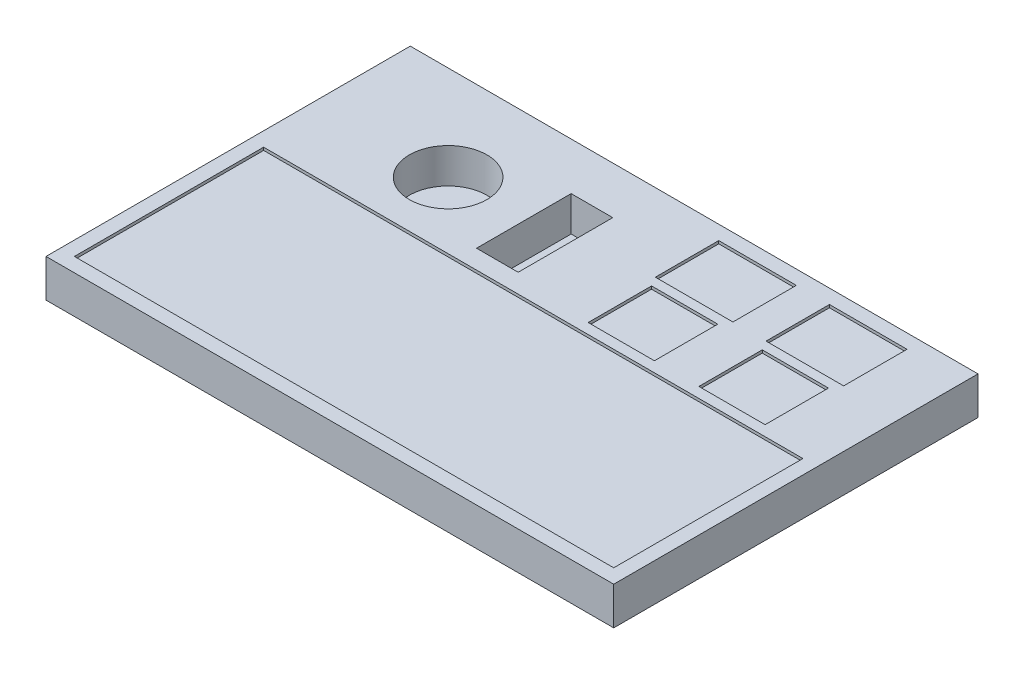
ISO-10303-21;
HEADER;
FILE_DESCRIPTION(('STEP AP214'),'2;1');
FILE_NAME('part.step','',(''),(''),'','','');
FILE_SCHEMA(('AUTOMOTIVE_DESIGN { 1 0 10303 214 1 1 1 1 }'));
ENDSEC;
DATA;
#1=APPLICATION_CONTEXT('core data for automotive mechanical design processes');
#2=APPLICATION_PROTOCOL_DEFINITION('international standard','automotive_design',2000,#1);
#3=PRODUCT_CONTEXT('',#1,'mechanical');
#4=PRODUCT('Part','Part','',(#3));
#5=PRODUCT_RELATED_PRODUCT_CATEGORY('part','',(#4));
#6=PRODUCT_DEFINITION_FORMATION('','',#4);
#7=PRODUCT_DEFINITION_CONTEXT('part definition',#1,'design');
#8=PRODUCT_DEFINITION('design','',#6,#7);
#9=PRODUCT_DEFINITION_SHAPE('','',#8);
#10=(LENGTH_UNIT() NAMED_UNIT(*) SI_UNIT(.MILLI.,.METRE.));
#11=(NAMED_UNIT(*) PLANE_ANGLE_UNIT() SI_UNIT($,.RADIAN.));
#12=(NAMED_UNIT(*) SI_UNIT($,.STERADIAN.) SOLID_ANGLE_UNIT());
#13=UNCERTAINTY_MEASURE_WITH_UNIT(LENGTH_MEASURE(1.E-05),#10,'distance_accuracy_value','');
#14=(GEOMETRIC_REPRESENTATION_CONTEXT(3) GLOBAL_UNCERTAINTY_ASSIGNED_CONTEXT((#13)) GLOBAL_UNIT_ASSIGNED_CONTEXT((#10,
#11,#12)) REPRESENTATION_CONTEXT('',''));
#15=CARTESIAN_POINT('',(0.,0.,0.));
#16=DIRECTION('',(0.,0.,1.));
#17=DIRECTION('',(1.,0.,0.));
#18=AXIS2_PLACEMENT_3D('',#15,#16,#17);
#19=CARTESIAN_POINT('',(0.,0.,0.));
#20=DIRECTION('',(0.,1.,0.));
#21=DIRECTION('',(0.,0.,1.));
#22=AXIS2_PLACEMENT_3D('',#19,#20,#21);
#23=PLANE('',#22);
#24=CARTESIAN_POINT('',(-160.,0.,-92.5000000000001));
#25=DIRECTION('',(0.,1.,0.));
#26=DIRECTION('',(0.,0.,1.));
#27=AXIS2_PLACEMENT_3D('',#24,#25,#26);
#28=CIRCLE('',#27,41.);
#29=CARTESIAN_POINT('',(-160.,0.,-51.5000000000001));
#30=VERTEX_POINT('',#29);
#31=EDGE_CURVE('E620',#30,#30,#28,.T.);
#32=ORIENTED_EDGE('',*,*,#31,.F.);
#33=EDGE_LOOP('',(#32));
#34=FACE_BOUND('',#33,.T.);
#35=DIRECTION('',(1.,0.,0.));
#36=VECTOR('',#35,1.);
#37=CARTESIAN_POINT('',(0.,0.,177.5));
#38=LINE('',#37,#36);
#39=CARTESIAN_POINT('',(-285.,0.,177.5));
#40=VERTEX_POINT('',#39);
#41=CARTESIAN_POINT('',(285.,0.,177.5));
#42=VERTEX_POINT('',#41);
#43=EDGE_CURVE('E290',#40,#42,#38,.T.);
#44=ORIENTED_EDGE('',*,*,#43,.F.);
#45=DIRECTION('',(0.,0.,1.));
#46=VECTOR('',#45,1.);
#47=CARTESIAN_POINT('',(-285.,0.,0.));
#48=LINE('',#47,#46);
#49=CARTESIAN_POINT('',(-285.,0.,-22.5000000000001));
#50=VERTEX_POINT('',#49);
#51=EDGE_CURVE('E292',#50,#40,#48,.T.);
#52=ORIENTED_EDGE('',*,*,#51,.F.);
#53=DIRECTION('',(1.,0.,0.));
#54=VECTOR('',#53,1.);
#55=CARTESIAN_POINT('',(0.,0.,-22.5000000000001));
#56=LINE('',#55,#54);
#57=CARTESIAN_POINT('',(285.,0.,-22.5000000000001));
#58=VERTEX_POINT('',#57);
#59=EDGE_CURVE('E296',#50,#58,#56,.T.);
#60=ORIENTED_EDGE('',*,*,#59,.T.);
#61=DIRECTION('',(0.,0.,1.));
#62=VECTOR('',#61,1.);
#63=CARTESIAN_POINT('',(285.,0.,0.));
#64=LINE('',#63,#62);
#65=EDGE_CURVE('E299',#58,#42,#64,.T.);
#66=ORIENTED_EDGE('',*,*,#65,.T.);
#67=EDGE_LOOP('',(#44,#52,#60,#66));
#68=FACE_BOUND('',#67,.T.);
#69=DIRECTION('',(0.,0.,-1.));
#70=VECTOR('',#69,1.);
#71=CARTESIAN_POINT('',(300.,0.,-192.5));
#72=LINE('',#71,#70);
#73=CARTESIAN_POINT('',(300.,0.,192.5));
#74=VERTEX_POINT('',#73);
#75=CARTESIAN_POINT('',(300.,0.,-192.5));
#76=VERTEX_POINT('',#75);
#77=EDGE_CURVE('E427',#74,#76,#72,.T.);
#78=ORIENTED_EDGE('',*,*,#77,.T.);
#79=DIRECTION('',(-1.,0.,0.));
#80=VECTOR('',#79,1.);
#81=CARTESIAN_POINT('',(-300.,0.,-192.5));
#82=LINE('',#81,#80);
#83=CARTESIAN_POINT('',(-300.,0.,-192.5));
#84=VERTEX_POINT('',#83);
#85=EDGE_CURVE('E449',#76,#84,#82,.T.);
#86=ORIENTED_EDGE('',*,*,#85,.T.);
#87=DIRECTION('',(0.,0.,1.));
#88=VECTOR('',#87,1.);
#89=CARTESIAN_POINT('',(-300.,0.,-192.5));
#90=LINE('',#89,#88);
#91=CARTESIAN_POINT('',(-300.,0.,192.5));
#92=VERTEX_POINT('',#91);
#93=EDGE_CURVE('E452',#84,#92,#90,.T.);
#94=ORIENTED_EDGE('',*,*,#93,.T.);
#95=DIRECTION('',(1.,0.,0.));
#96=VECTOR('',#95,1.);
#97=CARTESIAN_POINT('',(-300.,0.,192.5));
#98=LINE('',#97,#96);
#99=EDGE_CURVE('E438',#92,#74,#98,.T.);
#100=ORIENTED_EDGE('',*,*,#99,.T.);
#101=EDGE_LOOP('',(#78,#86,#94,#100));
#102=FACE_BOUND('',#101,.T.);
#103=DIRECTION('',(1.,0.,0.));
#104=VECTOR('',#103,1.);
#105=CARTESIAN_POINT('',(0.,0.,-177.5));
#106=LINE('',#105,#104);
#107=CARTESIAN_POINT('',(41.,0.,-177.5));
#108=VERTEX_POINT('',#107);
#109=CARTESIAN_POINT('',(123.,0.,-177.5));
#110=VERTEX_POINT('',#109);
#111=EDGE_CURVE('E417',#108,#110,#106,.T.);
#112=ORIENTED_EDGE('',*,*,#111,.T.);
#113=DIRECTION('',(0.,0.,1.));
#114=VECTOR('',#113,1.);
#115=CARTESIAN_POINT('',(123.,0.,0.));
#116=LINE('',#115,#114);
#117=CARTESIAN_POINT('',(123.,0.,-110.5));
#118=VERTEX_POINT('',#117);
#119=EDGE_CURVE('E365',#110,#118,#116,.T.);
#120=ORIENTED_EDGE('',*,*,#119,.T.);
#121=DIRECTION('',(1.,0.,0.));
#122=VECTOR('',#121,1.);
#123=CARTESIAN_POINT('',(0.,0.,-110.5));
#124=LINE('',#123,#122);
#125=CARTESIAN_POINT('',(41.,0.,-110.5));
#126=VERTEX_POINT('',#125);
#127=EDGE_CURVE('E406',#126,#118,#124,.T.);
#128=ORIENTED_EDGE('',*,*,#127,.F.);
#129=DIRECTION('',(0.,0.,1.));
#130=VECTOR('',#129,1.);
#131=CARTESIAN_POINT('',(40.9999999999999,0.,0.));
#132=LINE('',#131,#130);
#133=EDGE_CURVE('E420',#108,#126,#132,.T.);
#134=ORIENTED_EDGE('',*,*,#133,.F.);
#135=EDGE_LOOP('',(#112,#120,#128,#134));
#136=FACE_BOUND('',#135,.T.);
#137=DIRECTION('',(0.,0.,1.));
#138=VECTOR('',#137,1.);
#139=CARTESIAN_POINT('',(46.9999999999999,0.,-100.5));
#140=LINE('',#139,#138);
#141=CARTESIAN_POINT('',(46.9999999999999,0.,-100.5));
#142=VERTEX_POINT('',#141);
#143=CARTESIAN_POINT('',(46.9999999999999,0.,-33.5));
#144=VERTEX_POINT('',#143);
#145=EDGE_CURVE('E323',#142,#144,#140,.T.);
#146=ORIENTED_EDGE('',*,*,#145,.F.);
#147=DIRECTION('',(1.,0.,0.));
#148=VECTOR('',#147,1.);
#149=CARTESIAN_POINT('',(46.9999999999999,0.,-100.5));
#150=LINE('',#149,#148);
#151=CARTESIAN_POINT('',(117.,0.,-100.5));
#152=VERTEX_POINT('',#151);
#153=EDGE_CURVE('E289',#142,#152,#150,.T.);
#154=ORIENTED_EDGE('',*,*,#153,.T.);
#155=DIRECTION('',(0.,0.,1.));
#156=VECTOR('',#155,1.);
#157=CARTESIAN_POINT('',(117.,0.,-100.5));
#158=LINE('',#157,#156);
#159=CARTESIAN_POINT('',(117.,0.,-33.5));
#160=VERTEX_POINT('',#159);
#161=EDGE_CURVE('E330',#152,#160,#158,.T.);
#162=ORIENTED_EDGE('',*,*,#161,.T.);
#163=DIRECTION('',(1.,0.,0.));
#164=VECTOR('',#163,1.);
#165=CARTESIAN_POINT('',(46.9999999999999,0.,-33.5));
#166=LINE('',#165,#164);
#167=EDGE_CURVE('E326',#144,#160,#166,.T.);
#168=ORIENTED_EDGE('',*,*,#167,.F.);
#169=EDGE_LOOP('',(#146,#154,#162,#168));
#170=FACE_BOUND('',#169,.T.);
#171=DIRECTION('',(1.,0.,0.));
#172=VECTOR('',#171,1.);
#173=CARTESIAN_POINT('',(0.,0.,-100.5));
#174=LINE('',#173,#172);
#175=CARTESIAN_POINT('',(164.,0.,-100.5));
#176=VERTEX_POINT('',#175);
#177=CARTESIAN_POINT('',(234.,0.,-100.5));
#178=VERTEX_POINT('',#177);
#179=EDGE_CURVE('E390',#176,#178,#174,.T.);
#180=ORIENTED_EDGE('',*,*,#179,.T.);
#181=DIRECTION('',(0.,0.,1.));
#182=VECTOR('',#181,1.);
#183=CARTESIAN_POINT('',(233.999999999999,0.,2.32649720384137E-12));
#184=LINE('',#183,#182);
#185=CARTESIAN_POINT('',(234.,0.,-33.5));
#186=VERTEX_POINT('',#185);
#187=EDGE_CURVE('E353',#178,#186,#184,.T.);
#188=ORIENTED_EDGE('',*,*,#187,.T.);
#189=DIRECTION('',(1.,0.,0.));
#190=VECTOR('',#189,1.);
#191=CARTESIAN_POINT('',(0.,0.,-33.5));
#192=LINE('',#191,#190);
#193=CARTESIAN_POINT('',(163.999999999999,0.,-33.5));
#194=VERTEX_POINT('',#193);
#195=EDGE_CURVE('E383',#194,#186,#192,.T.);
#196=ORIENTED_EDGE('',*,*,#195,.F.);
#197=DIRECTION('',(0.,0.,1.));
#198=VECTOR('',#197,1.);
#199=CARTESIAN_POINT('',(163.999999999999,0.,1.63053650183753E-12));
#200=LINE('',#199,#198);
#201=EDGE_CURVE('E386',#176,#194,#200,.T.);
#202=ORIENTED_EDGE('',*,*,#201,.F.);
#203=EDGE_LOOP('',(#180,#188,#196,#202));
#204=FACE_BOUND('',#203,.T.);
#205=DIRECTION('',(1.,0.,0.));
#206=VECTOR('',#205,1.);
#207=CARTESIAN_POINT('',(0.,0.,-177.5));
#208=LINE('',#207,#206);
#209=CARTESIAN_POINT('',(158.,0.,-177.5));
#210=VERTEX_POINT('',#209);
#211=CARTESIAN_POINT('',(240.,0.,-177.5));
#212=VERTEX_POINT('',#211);
#213=EDGE_CURVE('E361',#210,#212,#208,.T.);
#214=ORIENTED_EDGE('',*,*,#213,.T.);
#215=DIRECTION('',(0.,0.,1.));
#216=VECTOR('',#215,1.);
#217=CARTESIAN_POINT('',(240.,0.,0.));
#218=LINE('',#217,#216);
#219=CARTESIAN_POINT('',(240.,0.,-110.5));
#220=VERTEX_POINT('',#219);
#221=EDGE_CURVE('E84',#212,#220,#218,.T.);
#222=ORIENTED_EDGE('',*,*,#221,.T.);
#223=DIRECTION('',(1.,0.,0.));
#224=VECTOR('',#223,1.);
#225=CARTESIAN_POINT('',(0.,0.,-110.5));
#226=LINE('',#225,#224);
#227=CARTESIAN_POINT('',(158.,0.,-110.5));
#228=VERTEX_POINT('',#227);
#229=EDGE_CURVE('E354',#228,#220,#226,.T.);
#230=ORIENTED_EDGE('',*,*,#229,.F.);
#231=DIRECTION('',(0.,0.,1.));
#232=VECTOR('',#231,1.);
#233=CARTESIAN_POINT('',(158.,0.,0.));
#234=LINE('',#233,#232);
#235=EDGE_CURVE('E357',#210,#228,#234,.T.);
#236=ORIENTED_EDGE('',*,*,#235,.F.);
#237=EDGE_LOOP('',(#214,#222,#230,#236));
#238=FACE_BOUND('',#237,.T.);
#239=DIRECTION('',(0.,0.,1.));
#240=VECTOR('',#239,1.);
#241=CARTESIAN_POINT('',(-79.9999999999998,0.,0.));
#242=LINE('',#241,#240);
#243=CARTESIAN_POINT('',(-79.9999999999999,0.,-142.5));
#244=VERTEX_POINT('',#243);
#245=CARTESIAN_POINT('',(-79.9999999999998,0.,-42.5));
#246=VERTEX_POINT('',#245);
#247=EDGE_CURVE('E267',#244,#246,#242,.T.);
#248=ORIENTED_EDGE('',*,*,#247,.F.);
#249=DIRECTION('',(1.,0.,0.));
#250=VECTOR('',#249,1.);
#251=CARTESIAN_POINT('',(0.,0.,-142.5));
#252=LINE('',#251,#250);
#253=CARTESIAN_POINT('',(-35.9999999999999,0.,-142.5));
#254=VERTEX_POINT('',#253);
#255=EDGE_CURVE('E252',#244,#254,#252,.T.);
#256=ORIENTED_EDGE('',*,*,#255,.T.);
#257=DIRECTION('',(0.,0.,1.));
#258=VECTOR('',#257,1.);
#259=CARTESIAN_POINT('',(-35.9999999999999,0.,0.));
#260=LINE('',#259,#258);
#261=CARTESIAN_POINT('',(-35.9999999999999,0.,-42.5));
#262=VERTEX_POINT('',#261);
#263=EDGE_CURVE('E261',#254,#262,#260,.T.);
#264=ORIENTED_EDGE('',*,*,#263,.T.);
#265=DIRECTION('',(1.,0.,0.));
#266=VECTOR('',#265,1.);
#267=CARTESIAN_POINT('',(0.,0.,-42.5));
#268=LINE('',#267,#266);
#269=EDGE_CURVE('E76',#246,#262,#268,.T.);
#270=ORIENTED_EDGE('',*,*,#269,.F.);
#271=EDGE_LOOP('',(#248,#256,#264,#270));
#272=FACE_BOUND('',#271,.T.);
#273=ADVANCED_FACE('F59',(#34,#68,#102,#136,#170,#204,#238,#272),#23,.T.);
#274=CARTESIAN_POINT('',(300.,-40.,-192.5));
#275=DIRECTION('',(1.,0.,0.));
#276=DIRECTION('',(0.,0.,-1.));
#277=AXIS2_PLACEMENT_3D('',#274,#275,#276);
#278=PLANE('',#277);
#279=ORIENTED_EDGE('',*,*,#77,.F.);
#280=DIRECTION('',(0.,1.,0.));
#281=VECTOR('',#280,1.);
#282=CARTESIAN_POINT('',(300.,-40.,192.5));
#283=LINE('',#282,#281);
#284=CARTESIAN_POINT('',(300.,-40.,192.5));
#285=VERTEX_POINT('',#284);
#286=EDGE_CURVE('E13',#285,#74,#283,.T.);
#287=ORIENTED_EDGE('',*,*,#286,.F.);
#288=DIRECTION('',(0.,0.,-1.));
#289=VECTOR('',#288,1.);
#290=CARTESIAN_POINT('',(300.,-40.,-192.5));
#291=LINE('',#290,#289);
#292=CARTESIAN_POINT('',(300.,-40.,-192.5));
#293=VERTEX_POINT('',#292);
#294=EDGE_CURVE('E434',#285,#293,#291,.T.);
#295=ORIENTED_EDGE('',*,*,#294,.T.);
#296=DIRECTION('',(0.,1.,0.));
#297=VECTOR('',#296,1.);
#298=CARTESIAN_POINT('',(300.,-40.,-192.5));
#299=LINE('',#298,#297);
#300=EDGE_CURVE('E63',#293,#76,#299,.T.);
#301=ORIENTED_EDGE('',*,*,#300,.T.);
#302=EDGE_LOOP('',(#279,#287,#295,#301));
#303=FACE_BOUND('',#302,.T.);
#304=ADVANCED_FACE('F61',(#303),#278,.T.);
#305=CARTESIAN_POINT('',(-300.,-40.,192.5));
#306=DIRECTION('',(0.,0.,1.));
#307=DIRECTION('',(1.,0.,0.));
#308=AXIS2_PLACEMENT_3D('',#305,#306,#307);
#309=PLANE('',#308);
#310=ORIENTED_EDGE('',*,*,#99,.F.);
#311=DIRECTION('',(0.,1.,0.));
#312=VECTOR('',#311,1.);
#313=CARTESIAN_POINT('',(-300.,-40.,192.5));
#314=LINE('',#313,#312);
#315=CARTESIAN_POINT('',(-300.,-40.,192.5));
#316=VERTEX_POINT('',#315);
#317=EDGE_CURVE('E68',#316,#92,#314,.T.);
#318=ORIENTED_EDGE('',*,*,#317,.F.);
#319=DIRECTION('',(1.,0.,0.));
#320=VECTOR('',#319,1.);
#321=CARTESIAN_POINT('',(-300.,-40.,192.5));
#322=LINE('',#321,#320);
#323=EDGE_CURVE('E444',#316,#285,#322,.T.);
#324=ORIENTED_EDGE('',*,*,#323,.T.);
#325=ORIENTED_EDGE('',*,*,#286,.T.);
#326=EDGE_LOOP('',(#310,#318,#324,#325));
#327=FACE_BOUND('',#326,.T.);
#328=ADVANCED_FACE('F470',(#327),#309,.T.);
#329=CARTESIAN_POINT('',(-300.,-40.,-192.5));
#330=DIRECTION('',(-1.,0.,0.));
#331=DIRECTION('',(0.,0.,1.));
#332=AXIS2_PLACEMENT_3D('',#329,#330,#331);
#333=PLANE('',#332);
#334=ORIENTED_EDGE('',*,*,#93,.F.);
#335=DIRECTION('',(0.,1.,0.));
#336=VECTOR('',#335,1.);
#337=CARTESIAN_POINT('',(-300.,-40.,-192.5));
#338=LINE('',#337,#336);
#339=CARTESIAN_POINT('',(-300.,-40.,-192.5));
#340=VERTEX_POINT('',#339);
#341=EDGE_CURVE('E457',#340,#84,#338,.T.);
#342=ORIENTED_EDGE('',*,*,#341,.F.);
#343=DIRECTION('',(0.,0.,1.));
#344=VECTOR('',#343,1.);
#345=CARTESIAN_POINT('',(-300.,-40.,-192.5));
#346=LINE('',#345,#344);
#347=EDGE_CURVE('E441',#340,#316,#346,.T.);
#348=ORIENTED_EDGE('',*,*,#347,.T.);
#349=ORIENTED_EDGE('',*,*,#317,.T.);
#350=EDGE_LOOP('',(#334,#342,#348,#349));
#351=FACE_BOUND('',#350,.T.);
#352=ADVANCED_FACE('F476',(#351),#333,.T.);
#353=CARTESIAN_POINT('',(-300.,-40.,-192.5));
#354=DIRECTION('',(0.,0.,-1.));
#355=DIRECTION('',(-1.,0.,0.));
#356=AXIS2_PLACEMENT_3D('',#353,#354,#355);
#357=PLANE('',#356);
#358=ORIENTED_EDGE('',*,*,#85,.F.);
#359=ORIENTED_EDGE('',*,*,#300,.F.);
#360=DIRECTION('',(-1.,0.,0.));
#361=VECTOR('',#360,1.);
#362=CARTESIAN_POINT('',(-300.,-40.,-192.5));
#363=LINE('',#362,#361);
#364=EDGE_CURVE('E437',#293,#340,#363,.T.);
#365=ORIENTED_EDGE('',*,*,#364,.T.);
#366=ORIENTED_EDGE('',*,*,#341,.T.);
#367=EDGE_LOOP('',(#358,#359,#365,#366));
#368=FACE_BOUND('',#367,.T.);
#369=ADVANCED_FACE('F465',(#368),#357,.T.);
#370=CARTESIAN_POINT('',(0.,-40.,0.));
#371=DIRECTION('',(0.,1.,0.));
#372=DIRECTION('',(0.,0.,1.));
#373=AXIS2_PLACEMENT_3D('',#370,#371,#372);
#374=PLANE('',#373);
#375=ORIENTED_EDGE('',*,*,#294,.F.);
#376=ORIENTED_EDGE('',*,*,#323,.F.);
#377=ORIENTED_EDGE('',*,*,#347,.F.);
#378=ORIENTED_EDGE('',*,*,#364,.F.);
#379=EDGE_LOOP('',(#375,#376,#377,#378));
#380=FACE_BOUND('',#379,.T.);
#381=ADVANCED_FACE('F473',(#380),#374,.F.);
#382=CARTESIAN_POINT('',(123.,-3.,0.));
#383=DIRECTION('',(-1.,0.,0.));
#384=DIRECTION('',(0.,0.,1.));
#385=AXIS2_PLACEMENT_3D('',#382,#383,#384);
#386=PLANE('',#385);
#387=ORIENTED_EDGE('',*,*,#119,.F.);
#388=DIRECTION('',(0.,1.,0.));
#389=VECTOR('',#388,1.);
#390=CARTESIAN_POINT('',(123.,-3.,-177.5));
#391=LINE('',#390,#389);
#392=CARTESIAN_POINT('',(123.,-3.,-177.5));
#393=VERTEX_POINT('',#392);
#394=EDGE_CURVE('E414',#393,#110,#391,.T.);
#395=ORIENTED_EDGE('',*,*,#394,.F.);
#396=DIRECTION('',(0.,0.,1.));
#397=VECTOR('',#396,1.);
#398=CARTESIAN_POINT('',(123.,-3.,0.));
#399=LINE('',#398,#397);
#400=CARTESIAN_POINT('',(123.,-3.,-110.5));
#401=VERTEX_POINT('',#400);
#402=EDGE_CURVE('E403',#393,#401,#399,.T.);
#403=ORIENTED_EDGE('',*,*,#402,.T.);
#404=DIRECTION('',(0.,1.,0.));
#405=VECTOR('',#404,1.);
#406=CARTESIAN_POINT('',(123.,-3.,-110.5));
#407=LINE('',#406,#405);
#408=EDGE_CURVE('E425',#401,#118,#407,.T.);
#409=ORIENTED_EDGE('',*,*,#408,.T.);
#410=EDGE_LOOP('',(#387,#395,#403,#409));
#411=FACE_BOUND('',#410,.T.);
#412=ADVANCED_FACE('F495',(#411),#386,.T.);
#413=CARTESIAN_POINT('',(0.,-3.,-110.5));
#414=DIRECTION('',(0.,0.,1.));
#415=DIRECTION('',(1.,0.,0.));
#416=AXIS2_PLACEMENT_3D('',#413,#414,#415);
#417=PLANE('',#416);
#418=ORIENTED_EDGE('',*,*,#127,.T.);
#419=ORIENTED_EDGE('',*,*,#408,.F.);
#420=DIRECTION('',(1.,0.,0.));
#421=VECTOR('',#420,1.);
#422=CARTESIAN_POINT('',(0.,-3.,-110.5));
#423=LINE('',#422,#421);
#424=CARTESIAN_POINT('',(41.,-3.,-110.5));
#425=VERTEX_POINT('',#424);
#426=EDGE_CURVE('E411',#425,#401,#423,.T.);
#427=ORIENTED_EDGE('',*,*,#426,.F.);
#428=DIRECTION('',(0.,1.,0.));
#429=VECTOR('',#428,1.);
#430=CARTESIAN_POINT('',(41.,-3.,-110.5));
#431=LINE('',#430,#429);
#432=EDGE_CURVE('E428',#425,#126,#431,.T.);
#433=ORIENTED_EDGE('',*,*,#432,.T.);
#434=EDGE_LOOP('',(#418,#419,#427,#433));
#435=FACE_BOUND('',#434,.T.);
#436=ADVANCED_FACE('F498',(#435),#417,.F.);
#437=CARTESIAN_POINT('',(40.9999999999999,-3.,0.));
#438=DIRECTION('',(-1.,0.,0.));
#439=DIRECTION('',(0.,0.,1.));
#440=AXIS2_PLACEMENT_3D('',#437,#438,#439);
#441=PLANE('',#440);
#442=ORIENTED_EDGE('',*,*,#133,.T.);
#443=ORIENTED_EDGE('',*,*,#432,.F.);
#444=DIRECTION('',(0.,0.,1.));
#445=VECTOR('',#444,1.);
#446=CARTESIAN_POINT('',(40.9999999999999,-3.,0.));
#447=LINE('',#446,#445);
#448=CARTESIAN_POINT('',(41.,-3.,-177.5));
#449=VERTEX_POINT('',#448);
#450=EDGE_CURVE('E408',#449,#425,#447,.T.);
#451=ORIENTED_EDGE('',*,*,#450,.F.);
#452=DIRECTION('',(0.,1.,0.));
#453=VECTOR('',#452,1.);
#454=CARTESIAN_POINT('',(41.,-3.,-177.5));
#455=LINE('',#454,#453);
#456=EDGE_CURVE('E430',#449,#108,#455,.T.);
#457=ORIENTED_EDGE('',*,*,#456,.T.);
#458=EDGE_LOOP('',(#442,#443,#451,#457));
#459=FACE_BOUND('',#458,.T.);
#460=ADVANCED_FACE('F504',(#459),#441,.F.);
#461=CARTESIAN_POINT('',(0.,-3.,-177.5));
#462=DIRECTION('',(0.,0.,1.));
#463=DIRECTION('',(1.,0.,0.));
#464=AXIS2_PLACEMENT_3D('',#461,#462,#463);
#465=PLANE('',#464);
#466=ORIENTED_EDGE('',*,*,#111,.F.);
#467=ORIENTED_EDGE('',*,*,#456,.F.);
#468=DIRECTION('',(1.,0.,0.));
#469=VECTOR('',#468,1.);
#470=CARTESIAN_POINT('',(0.,-3.,-177.5));
#471=LINE('',#470,#469);
#472=EDGE_CURVE('E405',#449,#393,#471,.T.);
#473=ORIENTED_EDGE('',*,*,#472,.T.);
#474=ORIENTED_EDGE('',*,*,#394,.T.);
#475=EDGE_LOOP('',(#466,#467,#473,#474));
#476=FACE_BOUND('',#475,.T.);
#477=ADVANCED_FACE('F500',(#476),#465,.T.);
#478=CARTESIAN_POINT('',(0.,-3.,0.));
#479=DIRECTION('',(0.,1.,0.));
#480=DIRECTION('',(0.,0.,1.));
#481=AXIS2_PLACEMENT_3D('',#478,#479,#480);
#482=PLANE('',#481);
#483=ORIENTED_EDGE('',*,*,#402,.F.);
#484=ORIENTED_EDGE('',*,*,#472,.F.);
#485=ORIENTED_EDGE('',*,*,#450,.T.);
#486=ORIENTED_EDGE('',*,*,#426,.T.);
#487=EDGE_LOOP('',(#483,#484,#485,#486));
#488=FACE_BOUND('',#487,.T.);
#489=ADVANCED_FACE('F503',(#488),#482,.T.);
#490=CARTESIAN_POINT('',(46.9999999999999,-3.,-100.5));
#491=DIRECTION('',(0.,0.,1.));
#492=DIRECTION('',(1.,0.,0.));
#493=AXIS2_PLACEMENT_3D('',#490,#491,#492);
#494=PLANE('',#493);
#495=ORIENTED_EDGE('',*,*,#153,.F.);
#496=DIRECTION('',(0.,1.,0.));
#497=VECTOR('',#496,1.);
#498=CARTESIAN_POINT('',(46.9999999999999,-3.,-100.5));
#499=LINE('',#498,#497);
#500=CARTESIAN_POINT('',(46.9999999999999,-3.,-100.5));
#501=VERTEX_POINT('',#500);
#502=EDGE_CURVE('E319',#501,#142,#499,.T.);
#503=ORIENTED_EDGE('',*,*,#502,.F.);
#504=DIRECTION('',(1.,0.,0.));
#505=VECTOR('',#504,1.);
#506=CARTESIAN_POINT('',(46.9999999999999,-3.,-100.5));
#507=LINE('',#506,#505);
#508=CARTESIAN_POINT('',(117.,-3.,-100.5));
#509=VERTEX_POINT('',#508);
#510=EDGE_CURVE('E327',#501,#509,#507,.T.);
#511=ORIENTED_EDGE('',*,*,#510,.T.);
#512=DIRECTION('',(0.,1.,0.));
#513=VECTOR('',#512,1.);
#514=CARTESIAN_POINT('',(117.,-3.,-100.5));
#515=LINE('',#514,#513);
#516=EDGE_CURVE('E311',#509,#152,#515,.T.);
#517=ORIENTED_EDGE('',*,*,#516,.T.);
#518=EDGE_LOOP('',(#495,#503,#511,#517));
#519=FACE_BOUND('',#518,.T.);
#520=ADVANCED_FACE('F514',(#519),#494,.T.);
#521=CARTESIAN_POINT('',(117.,-3.,-100.5));
#522=DIRECTION('',(-1.,0.,0.));
#523=DIRECTION('',(0.,0.,1.));
#524=AXIS2_PLACEMENT_3D('',#521,#522,#523);
#525=PLANE('',#524);
#526=ORIENTED_EDGE('',*,*,#161,.F.);
#527=ORIENTED_EDGE('',*,*,#516,.F.);
#528=DIRECTION('',(0.,0.,1.));
#529=VECTOR('',#528,1.);
#530=CARTESIAN_POINT('',(117.,-3.,-100.5));
#531=LINE('',#530,#529);
#532=CARTESIAN_POINT('',(117.,-3.,-33.5));
#533=VERTEX_POINT('',#532);
#534=EDGE_CURVE('E340',#509,#533,#531,.T.);
#535=ORIENTED_EDGE('',*,*,#534,.T.);
#536=DIRECTION('',(0.,1.,0.));
#537=VECTOR('',#536,1.);
#538=CARTESIAN_POINT('',(117.,-3.,-33.5));
#539=LINE('',#538,#537);
#540=EDGE_CURVE('E314',#533,#160,#539,.T.);
#541=ORIENTED_EDGE('',*,*,#540,.T.);
#542=EDGE_LOOP('',(#526,#527,#535,#541));
#543=FACE_BOUND('',#542,.T.);
#544=ADVANCED_FACE('F568',(#543),#525,.T.);
#545=CARTESIAN_POINT('',(46.9999999999999,-3.,-33.5));
#546=DIRECTION('',(0.,0.,1.));
#547=DIRECTION('',(1.,0.,0.));
#548=AXIS2_PLACEMENT_3D('',#545,#546,#547);
#549=PLANE('',#548);
#550=ORIENTED_EDGE('',*,*,#167,.T.);
#551=ORIENTED_EDGE('',*,*,#540,.F.);
#552=DIRECTION('',(1.,0.,0.));
#553=VECTOR('',#552,1.);
#554=CARTESIAN_POINT('',(46.9999999999999,-3.,-33.5));
#555=LINE('',#554,#553);
#556=CARTESIAN_POINT('',(46.9999999999999,-3.,-33.5));
#557=VERTEX_POINT('',#556);
#558=EDGE_CURVE('E337',#557,#533,#555,.T.);
#559=ORIENTED_EDGE('',*,*,#558,.F.);
#560=DIRECTION('',(0.,1.,0.));
#561=VECTOR('',#560,1.);
#562=CARTESIAN_POINT('',(46.9999999999999,-3.,-33.5));
#563=LINE('',#562,#561);
#564=EDGE_CURVE('E317',#557,#144,#563,.T.);
#565=ORIENTED_EDGE('',*,*,#564,.T.);
#566=EDGE_LOOP('',(#550,#551,#559,#565));
#567=FACE_BOUND('',#566,.T.);
#568=ADVANCED_FACE('F564',(#567),#549,.F.);
#569=CARTESIAN_POINT('',(46.9999999999999,-3.,-100.5));
#570=DIRECTION('',(-1.,0.,0.));
#571=DIRECTION('',(0.,0.,1.));
#572=AXIS2_PLACEMENT_3D('',#569,#570,#571);
#573=PLANE('',#572);
#574=ORIENTED_EDGE('',*,*,#145,.T.);
#575=ORIENTED_EDGE('',*,*,#564,.F.);
#576=DIRECTION('',(0.,0.,1.));
#577=VECTOR('',#576,1.);
#578=CARTESIAN_POINT('',(46.9999999999999,-3.,-100.5));
#579=LINE('',#578,#577);
#580=EDGE_CURVE('E322',#501,#557,#579,.T.);
#581=ORIENTED_EDGE('',*,*,#580,.F.);
#582=ORIENTED_EDGE('',*,*,#502,.T.);
#583=EDGE_LOOP('',(#574,#575,#581,#582));
#584=FACE_BOUND('',#583,.T.);
#585=ADVANCED_FACE('F560',(#584),#573,.F.);
#586=CARTESIAN_POINT('',(0.,-3.,0.));
#587=DIRECTION('',(0.,-1.,0.));
#588=DIRECTION('',(0.,0.,-1.));
#589=AXIS2_PLACEMENT_3D('',#586,#587,#588);
#590=PLANE('',#589);
#591=ORIENTED_EDGE('',*,*,#510,.F.);
#592=ORIENTED_EDGE('',*,*,#580,.T.);
#593=ORIENTED_EDGE('',*,*,#558,.T.);
#594=ORIENTED_EDGE('',*,*,#534,.F.);
#595=EDGE_LOOP('',(#591,#592,#593,#594));
#596=FACE_BOUND('',#595,.T.);
#597=ADVANCED_FACE('F556',(#596),#590,.F.);
#598=CARTESIAN_POINT('',(0.,-3.,177.5));
#599=DIRECTION('',(0.,0.,1.));
#600=DIRECTION('',(1.,0.,0.));
#601=AXIS2_PLACEMENT_3D('',#598,#599,#600);
#602=PLANE('',#601);
#603=ORIENTED_EDGE('',*,*,#43,.T.);
#604=DIRECTION('',(0.,1.,0.));
#605=VECTOR('',#604,1.);
#606=CARTESIAN_POINT('',(285.,-3.,177.5));
#607=LINE('',#606,#605);
#608=CARTESIAN_POINT('',(285.,-3.,177.5));
#609=VERTEX_POINT('',#608);
#610=EDGE_CURVE('E286',#609,#42,#607,.T.);
#611=ORIENTED_EDGE('',*,*,#610,.F.);
#612=DIRECTION('',(1.,0.,0.));
#613=VECTOR('',#612,1.);
#614=CARTESIAN_POINT('',(0.,-3.,177.5));
#615=LINE('',#614,#613);
#616=CARTESIAN_POINT('',(-285.,-3.,177.5));
#617=VERTEX_POINT('',#616);
#618=EDGE_CURVE('E281',#617,#609,#615,.T.);
#619=ORIENTED_EDGE('',*,*,#618,.F.);
#620=DIRECTION('',(0.,1.,0.));
#621=VECTOR('',#620,1.);
#622=CARTESIAN_POINT('',(-285.,-3.,177.5));
#623=LINE('',#622,#621);
#624=EDGE_CURVE('E284',#617,#40,#623,.T.);
#625=ORIENTED_EDGE('',*,*,#624,.T.);
#626=EDGE_LOOP('',(#603,#611,#619,#625));
#627=FACE_BOUND('',#626,.T.);
#628=ADVANCED_FACE('F559',(#627),#602,.F.);
#629=CARTESIAN_POINT('',(-285.,-3.,0.));
#630=DIRECTION('',(-1.,0.,0.));
#631=DIRECTION('',(0.,0.,1.));
#632=AXIS2_PLACEMENT_3D('',#629,#630,#631);
#633=PLANE('',#632);
#634=ORIENTED_EDGE('',*,*,#51,.T.);
#635=ORIENTED_EDGE('',*,*,#624,.F.);
#636=DIRECTION('',(0.,0.,1.));
#637=VECTOR('',#636,1.);
#638=CARTESIAN_POINT('',(-285.,-3.,0.));
#639=LINE('',#638,#637);
#640=CARTESIAN_POINT('',(-285.,-3.,-22.5000000000001));
#641=VERTEX_POINT('',#640);
#642=EDGE_CURVE('E305',#641,#617,#639,.T.);
#643=ORIENTED_EDGE('',*,*,#642,.F.);
#644=DIRECTION('',(0.,1.,0.));
#645=VECTOR('',#644,1.);
#646=CARTESIAN_POINT('',(-285.,-3.,-22.5000000000001));
#647=LINE('',#646,#645);
#648=EDGE_CURVE('E282',#641,#50,#647,.T.);
#649=ORIENTED_EDGE('',*,*,#648,.T.);
#650=EDGE_LOOP('',(#634,#635,#643,#649));
#651=FACE_BOUND('',#650,.T.);
#652=ADVANCED_FACE('F582',(#651),#633,.F.);
#653=CARTESIAN_POINT('',(0.,-3.,-22.5000000000001));
#654=DIRECTION('',(0.,0.,1.));
#655=DIRECTION('',(1.,0.,0.));
#656=AXIS2_PLACEMENT_3D('',#653,#654,#655);
#657=PLANE('',#656);
#658=ORIENTED_EDGE('',*,*,#59,.F.);
#659=ORIENTED_EDGE('',*,*,#648,.F.);
#660=DIRECTION('',(1.,0.,0.));
#661=VECTOR('',#660,1.);
#662=CARTESIAN_POINT('',(0.,-3.,-22.5000000000001));
#663=LINE('',#662,#661);
#664=CARTESIAN_POINT('',(285.,-3.,-22.5000000000001));
#665=VERTEX_POINT('',#664);
#666=EDGE_CURVE('E308',#641,#665,#663,.T.);
#667=ORIENTED_EDGE('',*,*,#666,.T.);
#668=DIRECTION('',(0.,1.,0.));
#669=VECTOR('',#668,1.);
#670=CARTESIAN_POINT('',(285.,-3.,-22.5000000000001));
#671=LINE('',#670,#669);
#672=EDGE_CURVE('E279',#665,#58,#671,.T.);
#673=ORIENTED_EDGE('',*,*,#672,.T.);
#674=EDGE_LOOP('',(#658,#659,#667,#673));
#675=FACE_BOUND('',#674,.T.);
#676=ADVANCED_FACE('F586',(#675),#657,.T.);
#677=CARTESIAN_POINT('',(285.,-3.,0.));
#678=DIRECTION('',(-1.,0.,0.));
#679=DIRECTION('',(0.,0.,1.));
#680=AXIS2_PLACEMENT_3D('',#677,#678,#679);
#681=PLANE('',#680);
#682=ORIENTED_EDGE('',*,*,#65,.F.);
#683=ORIENTED_EDGE('',*,*,#672,.F.);
#684=DIRECTION('',(0.,0.,1.));
#685=VECTOR('',#684,1.);
#686=CARTESIAN_POINT('',(285.,-3.,0.));
#687=LINE('',#686,#685);
#688=EDGE_CURVE('E293',#665,#609,#687,.T.);
#689=ORIENTED_EDGE('',*,*,#688,.T.);
#690=ORIENTED_EDGE('',*,*,#610,.T.);
#691=EDGE_LOOP('',(#682,#683,#689,#690));
#692=FACE_BOUND('',#691,.T.);
#693=ADVANCED_FACE('F578',(#692),#681,.T.);
#694=CARTESIAN_POINT('',(0.,-3.,0.));
#695=DIRECTION('',(0.,1.,0.));
#696=DIRECTION('',(0.,0.,1.));
#697=AXIS2_PLACEMENT_3D('',#694,#695,#696);
#698=PLANE('',#697);
#699=ORIENTED_EDGE('',*,*,#688,.F.);
#700=ORIENTED_EDGE('',*,*,#666,.F.);
#701=ORIENTED_EDGE('',*,*,#642,.T.);
#702=ORIENTED_EDGE('',*,*,#618,.T.);
#703=EDGE_LOOP('',(#699,#700,#701,#702));
#704=FACE_BOUND('',#703,.T.);
#705=ADVANCED_FACE('F536',(#704),#698,.T.);
#706=CARTESIAN_POINT('',(233.999999999999,-3.,2.32649720384137E-12));
#707=DIRECTION('',(-1.,0.,0.));
#708=DIRECTION('',(0.,0.,1.));
#709=AXIS2_PLACEMENT_3D('',#706,#707,#708);
#710=PLANE('',#709);
#711=ORIENTED_EDGE('',*,*,#187,.F.);
#712=DIRECTION('',(0.,1.,0.));
#713=VECTOR('',#712,1.);
#714=CARTESIAN_POINT('',(234.,-3.,-100.5));
#715=LINE('',#714,#713);
#716=CARTESIAN_POINT('',(234.,-3.,-100.5));
#717=VERTEX_POINT('',#716);
#718=EDGE_CURVE('E374',#717,#178,#715,.T.);
#719=ORIENTED_EDGE('',*,*,#718,.F.);
#720=DIRECTION('',(0.,0.,1.));
#721=VECTOR('',#720,1.);
#722=CARTESIAN_POINT('',(233.999999999999,-3.,2.32649720384137E-12));
#723=LINE('',#722,#721);
#724=CARTESIAN_POINT('',(234.,-3.,-33.5));
#725=VERTEX_POINT('',#724);
#726=EDGE_CURVE('E387',#717,#725,#723,.T.);
#727=ORIENTED_EDGE('',*,*,#726,.T.);
#728=DIRECTION('',(0.,1.,0.));
#729=VECTOR('',#728,1.);
#730=CARTESIAN_POINT('',(234.,-3.,-33.5));
#731=LINE('',#730,#729);
#732=EDGE_CURVE('E302',#725,#186,#731,.T.);
#733=ORIENTED_EDGE('',*,*,#732,.T.);
#734=EDGE_LOOP('',(#711,#719,#727,#733));
#735=FACE_BOUND('',#734,.T.);
#736=ADVANCED_FACE('F526',(#735),#710,.T.);
#737=CARTESIAN_POINT('',(0.,-3.,-33.5));
#738=DIRECTION('',(0.,0.,1.));
#739=DIRECTION('',(1.,0.,0.));
#740=AXIS2_PLACEMENT_3D('',#737,#738,#739);
#741=PLANE('',#740);
#742=ORIENTED_EDGE('',*,*,#195,.T.);
#743=ORIENTED_EDGE('',*,*,#732,.F.);
#744=DIRECTION('',(1.,0.,0.));
#745=VECTOR('',#744,1.);
#746=CARTESIAN_POINT('',(0.,-3.,-33.5));
#747=LINE('',#746,#745);
#748=CARTESIAN_POINT('',(163.999999999999,-3.,-33.5));
#749=VERTEX_POINT('',#748);
#750=EDGE_CURVE('E377',#749,#725,#747,.T.);
#751=ORIENTED_EDGE('',*,*,#750,.F.);
#752=DIRECTION('',(0.,1.,0.));
#753=VECTOR('',#752,1.);
#754=CARTESIAN_POINT('',(163.999999999999,-3.,-33.5));
#755=LINE('',#754,#753);
#756=EDGE_CURVE('E380',#749,#194,#755,.T.);
#757=ORIENTED_EDGE('',*,*,#756,.T.);
#758=EDGE_LOOP('',(#742,#743,#751,#757));
#759=FACE_BOUND('',#758,.T.);
#760=ADVANCED_FACE('F522',(#759),#741,.F.);
#761=CARTESIAN_POINT('',(163.999999999999,-3.,1.63053650183753E-12));
#762=DIRECTION('',(-1.,0.,0.));
#763=DIRECTION('',(0.,0.,1.));
#764=AXIS2_PLACEMENT_3D('',#761,#762,#763);
#765=PLANE('',#764);
#766=ORIENTED_EDGE('',*,*,#201,.T.);
#767=ORIENTED_EDGE('',*,*,#756,.F.);
#768=DIRECTION('',(0.,0.,1.));
#769=VECTOR('',#768,1.);
#770=CARTESIAN_POINT('',(163.999999999999,-3.,1.63053650183753E-12));
#771=LINE('',#770,#769);
#772=CARTESIAN_POINT('',(164.,-3.,-100.5));
#773=VERTEX_POINT('',#772);
#774=EDGE_CURVE('E397',#773,#749,#771,.T.);
#775=ORIENTED_EDGE('',*,*,#774,.F.);
#776=DIRECTION('',(0.,1.,0.));
#777=VECTOR('',#776,1.);
#778=CARTESIAN_POINT('',(164.,-3.,-100.5));
#779=LINE('',#778,#777);
#780=EDGE_CURVE('E378',#773,#176,#779,.T.);
#781=ORIENTED_EDGE('',*,*,#780,.T.);
#782=EDGE_LOOP('',(#766,#767,#775,#781));
#783=FACE_BOUND('',#782,.T.);
#784=ADVANCED_FACE('F525',(#783),#765,.F.);
#785=CARTESIAN_POINT('',(0.,-3.,-100.5));
#786=DIRECTION('',(0.,0.,1.));
#787=DIRECTION('',(1.,0.,0.));
#788=AXIS2_PLACEMENT_3D('',#785,#786,#787);
#789=PLANE('',#788);
#790=ORIENTED_EDGE('',*,*,#179,.F.);
#791=ORIENTED_EDGE('',*,*,#780,.F.);
#792=DIRECTION('',(1.,0.,0.));
#793=VECTOR('',#792,1.);
#794=CARTESIAN_POINT('',(0.,-3.,-100.5));
#795=LINE('',#794,#793);
#796=EDGE_CURVE('E400',#773,#717,#795,.T.);
#797=ORIENTED_EDGE('',*,*,#796,.T.);
#798=ORIENTED_EDGE('',*,*,#718,.T.);
#799=EDGE_LOOP('',(#790,#791,#797,#798));
#800=FACE_BOUND('',#799,.T.);
#801=ADVANCED_FACE('F520',(#800),#789,.T.);
#802=CARTESIAN_POINT('',(0.,-3.,0.));
#803=DIRECTION('',(0.,1.,0.));
#804=DIRECTION('',(0.,0.,1.));
#805=AXIS2_PLACEMENT_3D('',#802,#803,#804);
#806=PLANE('',#805);
#807=ORIENTED_EDGE('',*,*,#726,.F.);
#808=ORIENTED_EDGE('',*,*,#796,.F.);
#809=ORIENTED_EDGE('',*,*,#774,.T.);
#810=ORIENTED_EDGE('',*,*,#750,.T.);
#811=EDGE_LOOP('',(#807,#808,#809,#810));
#812=FACE_BOUND('',#811,.T.);
#813=ADVANCED_FACE('F516',(#812),#806,.T.);
#814=CARTESIAN_POINT('',(240.,-3.,0.));
#815=DIRECTION('',(-1.,0.,0.));
#816=DIRECTION('',(0.,0.,1.));
#817=AXIS2_PLACEMENT_3D('',#814,#815,#816);
#818=PLANE('',#817);
#819=ORIENTED_EDGE('',*,*,#221,.F.);
#820=DIRECTION('',(0.,1.,0.));
#821=VECTOR('',#820,1.);
#822=CARTESIAN_POINT('',(240.,-3.,-177.5));
#823=LINE('',#822,#821);
#824=CARTESIAN_POINT('',(240.,-3.,-177.5));
#825=VERTEX_POINT('',#824);
#826=EDGE_CURVE('E344',#825,#212,#823,.T.);
#827=ORIENTED_EDGE('',*,*,#826,.F.);
#828=DIRECTION('',(0.,0.,1.));
#829=VECTOR('',#828,1.);
#830=CARTESIAN_POINT('',(240.,-3.,0.));
#831=LINE('',#830,#829);
#832=CARTESIAN_POINT('',(240.,-3.,-110.5));
#833=VERTEX_POINT('',#832);
#834=EDGE_CURVE('E358',#825,#833,#831,.T.);
#835=ORIENTED_EDGE('',*,*,#834,.T.);
#836=DIRECTION('',(0.,1.,0.));
#837=VECTOR('',#836,1.);
#838=CARTESIAN_POINT('',(240.,-3.,-110.5));
#839=LINE('',#838,#837);
#840=EDGE_CURVE('E351',#833,#220,#839,.T.);
#841=ORIENTED_EDGE('',*,*,#840,.T.);
#842=EDGE_LOOP('',(#819,#827,#835,#841));
#843=FACE_BOUND('',#842,.T.);
#844=ADVANCED_FACE('F519',(#843),#818,.T.);
#845=CARTESIAN_POINT('',(0.,-3.,-110.5));
#846=DIRECTION('',(0.,0.,1.));
#847=DIRECTION('',(1.,0.,0.));
#848=AXIS2_PLACEMENT_3D('',#845,#846,#847);
#849=PLANE('',#848);
#850=ORIENTED_EDGE('',*,*,#229,.T.);
#851=ORIENTED_EDGE('',*,*,#840,.F.);
#852=DIRECTION('',(1.,0.,0.));
#853=VECTOR('',#852,1.);
#854=CARTESIAN_POINT('',(0.,-3.,-110.5));
#855=LINE('',#854,#853);
#856=CARTESIAN_POINT('',(158.,-3.,-110.5));
#857=VERTEX_POINT('',#856);
#858=EDGE_CURVE('E346',#857,#833,#855,.T.);
#859=ORIENTED_EDGE('',*,*,#858,.F.);
#860=DIRECTION('',(0.,1.,0.));
#861=VECTOR('',#860,1.);
#862=CARTESIAN_POINT('',(158.,-3.,-110.5));
#863=LINE('',#862,#861);
#864=EDGE_CURVE('E349',#857,#228,#863,.T.);
#865=ORIENTED_EDGE('',*,*,#864,.T.);
#866=EDGE_LOOP('',(#850,#851,#859,#865));
#867=FACE_BOUND('',#866,.T.);
#868=ADVANCED_FACE('F543',(#867),#849,.F.);
#869=CARTESIAN_POINT('',(158.,-3.,0.));
#870=DIRECTION('',(-1.,0.,0.));
#871=DIRECTION('',(0.,0.,1.));
#872=AXIS2_PLACEMENT_3D('',#869,#870,#871);
#873=PLANE('',#872);
#874=ORIENTED_EDGE('',*,*,#235,.T.);
#875=ORIENTED_EDGE('',*,*,#864,.F.);
#876=DIRECTION('',(0.,0.,1.));
#877=VECTOR('',#876,1.);
#878=CARTESIAN_POINT('',(158.,-3.,0.));
#879=LINE('',#878,#877);
#880=CARTESIAN_POINT('',(158.,-3.,-177.5));
#881=VERTEX_POINT('',#880);
#882=EDGE_CURVE('E368',#881,#857,#879,.T.);
#883=ORIENTED_EDGE('',*,*,#882,.F.);
#884=DIRECTION('',(0.,1.,0.));
#885=VECTOR('',#884,1.);
#886=CARTESIAN_POINT('',(158.,-3.,-177.5));
#887=LINE('',#886,#885);
#888=EDGE_CURVE('E347',#881,#210,#887,.T.);
#889=ORIENTED_EDGE('',*,*,#888,.T.);
#890=EDGE_LOOP('',(#874,#875,#883,#889));
#891=FACE_BOUND('',#890,.T.);
#892=ADVANCED_FACE('F546',(#891),#873,.F.);
#893=CARTESIAN_POINT('',(0.,-3.,-177.5));
#894=DIRECTION('',(0.,0.,1.));
#895=DIRECTION('',(1.,0.,0.));
#896=AXIS2_PLACEMENT_3D('',#893,#894,#895);
#897=PLANE('',#896);
#898=ORIENTED_EDGE('',*,*,#213,.F.);
#899=ORIENTED_EDGE('',*,*,#888,.F.);
#900=DIRECTION('',(1.,0.,0.));
#901=VECTOR('',#900,1.);
#902=CARTESIAN_POINT('',(0.,-3.,-177.5));
#903=LINE('',#902,#901);
#904=EDGE_CURVE('E371',#881,#825,#903,.T.);
#905=ORIENTED_EDGE('',*,*,#904,.T.);
#906=ORIENTED_EDGE('',*,*,#826,.T.);
#907=EDGE_LOOP('',(#898,#899,#905,#906));
#908=FACE_BOUND('',#907,.T.);
#909=ADVANCED_FACE('F541',(#908),#897,.T.);
#910=CARTESIAN_POINT('',(0.,-3.,0.));
#911=DIRECTION('',(0.,1.,0.));
#912=DIRECTION('',(0.,0.,1.));
#913=AXIS2_PLACEMENT_3D('',#910,#911,#912);
#914=PLANE('',#913);
#915=ORIENTED_EDGE('',*,*,#834,.F.);
#916=ORIENTED_EDGE('',*,*,#904,.F.);
#917=ORIENTED_EDGE('',*,*,#882,.T.);
#918=ORIENTED_EDGE('',*,*,#858,.T.);
#919=EDGE_LOOP('',(#915,#916,#917,#918));
#920=FACE_BOUND('',#919,.T.);
#921=ADVANCED_FACE('F538',(#920),#914,.T.);
#922=CARTESIAN_POINT('',(0.,-155.965512114594,-142.5));
#923=DIRECTION('',(0.,0.,1.));
#924=DIRECTION('',(1.,0.,0.));
#925=AXIS2_PLACEMENT_3D('',#922,#923,#924);
#926=PLANE('',#925);
#927=DIRECTION('',(0.,1.,0.));
#928=VECTOR('',#927,1.);
#929=CARTESIAN_POINT('',(-35.9999999999999,-155.965512114594,-142.5));
#930=LINE('',#929,#928);
#931=CARTESIAN_POINT('',(-35.9999999999999,-37.,-142.5));
#932=VERTEX_POINT('',#931);
#933=EDGE_CURVE('E247',#932,#254,#930,.T.);
#934=ORIENTED_EDGE('',*,*,#933,.T.);
#935=ORIENTED_EDGE('',*,*,#255,.F.);
#936=DIRECTION('',(0.,1.,0.));
#937=VECTOR('',#936,1.);
#938=CARTESIAN_POINT('',(-79.9999999999999,-155.965512114594,-142.5));
#939=LINE('',#938,#937);
#940=CARTESIAN_POINT('',(-79.9999999999999,-37.,-142.5));
#941=VERTEX_POINT('',#940);
#942=EDGE_CURVE('E258',#941,#244,#939,.T.);
#943=ORIENTED_EDGE('',*,*,#942,.F.);
#944=DIRECTION('',(-1.,0.,0.));
#945=VECTOR('',#944,1.);
#946=CARTESIAN_POINT('',(0.,-37.,-142.5));
#947=LINE('',#946,#945);
#948=EDGE_CURVE('E255',#932,#941,#947,.T.);
#949=ORIENTED_EDGE('',*,*,#948,.F.);
#950=EDGE_LOOP('',(#934,#935,#943,#949));
#951=FACE_BOUND('',#950,.T.);
#952=ADVANCED_FACE('F249',(#951),#926,.T.);
#953=CARTESIAN_POINT('',(-79.9999999999998,-155.965512114594,0.));
#954=DIRECTION('',(-1.,0.,0.));
#955=DIRECTION('',(0.,0.,1.));
#956=AXIS2_PLACEMENT_3D('',#953,#954,#955);
#957=PLANE('',#956);
#958=DIRECTION('',(0.,0.,-1.));
#959=VECTOR('',#958,1.);
#960=CARTESIAN_POINT('',(-79.9999999999998,-37.,0.));
#961=LINE('',#960,#959);
#962=CARTESIAN_POINT('',(-79.9999999999998,-37.,-42.5));
#963=VERTEX_POINT('',#962);
#964=EDGE_CURVE('E278',#963,#941,#961,.T.);
#965=ORIENTED_EDGE('',*,*,#964,.T.);
#966=ORIENTED_EDGE('',*,*,#942,.T.);
#967=ORIENTED_EDGE('',*,*,#247,.T.);
#968=DIRECTION('',(0.,1.,0.));
#969=VECTOR('',#968,1.);
#970=CARTESIAN_POINT('',(-79.9999999999998,-155.965512114594,-42.5));
#971=LINE('',#970,#969);
#972=EDGE_CURVE('E274',#963,#246,#971,.T.);
#973=ORIENTED_EDGE('',*,*,#972,.F.);
#974=EDGE_LOOP('',(#965,#966,#967,#973));
#975=FACE_BOUND('',#974,.T.);
#976=ADVANCED_FACE('F600',(#975),#957,.F.);
#977=CARTESIAN_POINT('',(0.,-155.965512114594,-42.5));
#978=DIRECTION('',(0.,0.,1.));
#979=DIRECTION('',(1.,0.,0.));
#980=AXIS2_PLACEMENT_3D('',#977,#978,#979);
#981=PLANE('',#980);
#982=DIRECTION('',(-1.,0.,0.));
#983=VECTOR('',#982,1.);
#984=CARTESIAN_POINT('',(0.,-37.,-42.5));
#985=LINE('',#984,#983);
#986=CARTESIAN_POINT('',(-35.9999999999999,-37.,-42.5));
#987=VERTEX_POINT('',#986);
#988=EDGE_CURVE('E627',#987,#963,#985,.T.);
#989=ORIENTED_EDGE('',*,*,#988,.T.);
#990=ORIENTED_EDGE('',*,*,#972,.T.);
#991=ORIENTED_EDGE('',*,*,#269,.T.);
#992=DIRECTION('',(0.,1.,0.));
#993=VECTOR('',#992,1.);
#994=CARTESIAN_POINT('',(-35.9999999999999,-155.965512114594,-42.5));
#995=LINE('',#994,#993);
#996=EDGE_CURVE('E263',#987,#262,#995,.T.);
#997=ORIENTED_EDGE('',*,*,#996,.F.);
#998=EDGE_LOOP('',(#989,#990,#991,#997));
#999=FACE_BOUND('',#998,.T.);
#1000=ADVANCED_FACE('F597',(#999),#981,.F.);
#1001=CARTESIAN_POINT('',(-35.9999999999999,-155.965512114594,0.));
#1002=DIRECTION('',(-1.,0.,0.));
#1003=DIRECTION('',(0.,0.,1.));
#1004=AXIS2_PLACEMENT_3D('',#1001,#1002,#1003);
#1005=PLANE('',#1004);
#1006=ORIENTED_EDGE('',*,*,#996,.T.);
#1007=ORIENTED_EDGE('',*,*,#263,.F.);
#1008=ORIENTED_EDGE('',*,*,#933,.F.);
#1009=DIRECTION('',(0.,0.,-1.));
#1010=VECTOR('',#1009,1.);
#1011=CARTESIAN_POINT('',(-35.9999999999999,-37.,0.));
#1012=LINE('',#1011,#1010);
#1013=EDGE_CURVE('E623',#987,#932,#1012,.T.);
#1014=ORIENTED_EDGE('',*,*,#1013,.F.);
#1015=EDGE_LOOP('',(#1006,#1007,#1008,#1014));
#1016=FACE_BOUND('',#1015,.T.);
#1017=ADVANCED_FACE('F262',(#1016),#1005,.T.);
#1018=CARTESIAN_POINT('',(0.,-37.,0.));
#1019=DIRECTION('',(0.,1.,0.));
#1020=DIRECTION('',(0.,0.,1.));
#1021=AXIS2_PLACEMENT_3D('',#1018,#1019,#1020);
#1022=PLANE('',#1021);
#1023=ORIENTED_EDGE('',*,*,#988,.F.);
#1024=ORIENTED_EDGE('',*,*,#1013,.T.);
#1025=ORIENTED_EDGE('',*,*,#948,.T.);
#1026=ORIENTED_EDGE('',*,*,#964,.F.);
#1027=EDGE_LOOP('',(#1023,#1024,#1025,#1026));
#1028=FACE_BOUND('',#1027,.T.);
#1029=ADVANCED_FACE('F596',(#1028),#1022,.T.);
#1030=CARTESIAN_POINT('',(-160.,-155.965512114594,-92.5000000000001));
#1031=DIRECTION('',(0.,1.,0.));
#1032=DIRECTION('',(0.,0.,1.));
#1033=AXIS2_PLACEMENT_3D('',#1030,#1031,#1032);
#1034=CYLINDRICAL_SURFACE('',#1033,41.);
#1035=CARTESIAN_POINT('',(-160.,-37.,-92.5000000000001));
#1036=DIRECTION('',(0.,1.,0.));
#1037=DIRECTION('',(0.,0.,1.));
#1038=AXIS2_PLACEMENT_3D('',#1035,#1036,#1037);
#1039=CIRCLE('',#1038,41.);
#1040=CARTESIAN_POINT('',(-160.,-37.,-51.5000000000001));
#1041=VERTEX_POINT('',#1040);
#1042=EDGE_CURVE('E315',#1041,#1041,#1039,.F.);
#1043=ORIENTED_EDGE('',*,*,#1042,.T.);
#1044=EDGE_LOOP('',(#1043));
#1045=FACE_BOUND('',#1044,.T.);
#1046=ORIENTED_EDGE('',*,*,#31,.T.);
#1047=EDGE_LOOP('',(#1046));
#1048=FACE_BOUND('',#1047,.T.);
#1049=ADVANCED_FACE('F608',(#1045,#1048),#1034,.F.);
#1050=CARTESIAN_POINT('',(0.,-37.,0.));
#1051=DIRECTION('',(0.,1.,0.));
#1052=DIRECTION('',(0.,0.,1.));
#1053=AXIS2_PLACEMENT_3D('',#1050,#1051,#1052);
#1054=PLANE('',#1053);
#1055=ORIENTED_EDGE('',*,*,#1042,.F.);
#1056=EDGE_LOOP('',(#1055));
#1057=FACE_BOUND('',#1056,.T.);
#1058=ADVANCED_FACE('F612',(#1057),#1054,.T.);
#1059=CLOSED_SHELL('',(#273,#304,#328,#352,#369,#381,#412,#436,#460,#477,#489,#520,#544,#568,
#585,#597,#628,#652,#676,#693,#705,#736,#760,#784,#801,#813,#844,#868,#892,#909,#921,#952,#976,
#1000,#1017,#1029,#1049,#1058));
#1060=MANIFOLD_SOLID_BREP('B2',#1059);
#1061=ADVANCED_BREP_SHAPE_REPRESENTATION('',(#18,#1060),#14);
#1062=SHAPE_DEFINITION_REPRESENTATION(#9,#1061);
ENDSEC;
END-ISO-10303-21;
